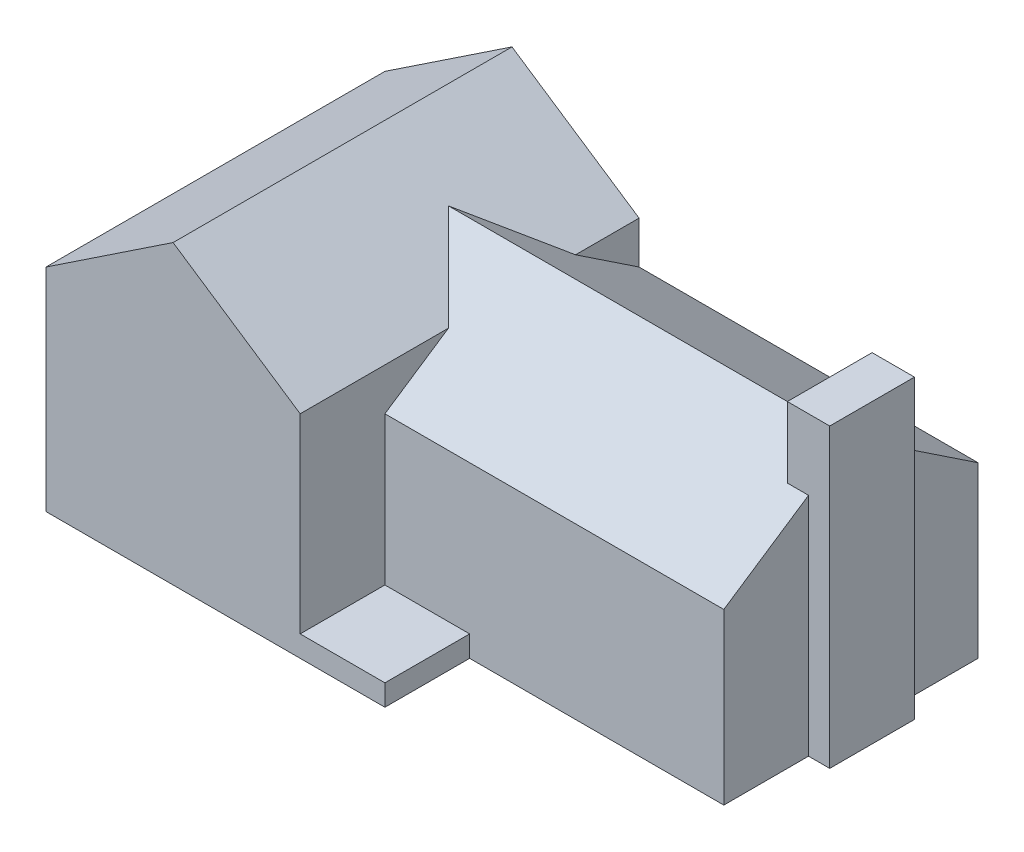
ISO-10303-21;
HEADER;
FILE_DESCRIPTION(('STEP AP214'),'2;1');
FILE_NAME('part.step','',(''),(''),'','','');
FILE_SCHEMA(('AUTOMOTIVE_DESIGN { 1 0 10303 214 1 1 1 1 }'));
ENDSEC;
DATA;
#1=APPLICATION_CONTEXT('core data for automotive mechanical design processes');
#2=APPLICATION_PROTOCOL_DEFINITION('international standard','automotive_design',2000,#1);
#3=PRODUCT_CONTEXT('',#1,'mechanical');
#4=PRODUCT('Part','Part','',(#3));
#5=PRODUCT_RELATED_PRODUCT_CATEGORY('part','',(#4));
#6=PRODUCT_DEFINITION_FORMATION('','',#4);
#7=PRODUCT_DEFINITION_CONTEXT('part definition',#1,'design');
#8=PRODUCT_DEFINITION('design','',#6,#7);
#9=PRODUCT_DEFINITION_SHAPE('','',#8);
#10=(LENGTH_UNIT() NAMED_UNIT(*) SI_UNIT(.MILLI.,.METRE.));
#11=(NAMED_UNIT(*) PLANE_ANGLE_UNIT() SI_UNIT($,.RADIAN.));
#12=(NAMED_UNIT(*) SI_UNIT($,.STERADIAN.) SOLID_ANGLE_UNIT());
#13=UNCERTAINTY_MEASURE_WITH_UNIT(LENGTH_MEASURE(1.E-05),#10,'distance_accuracy_value','');
#14=(GEOMETRIC_REPRESENTATION_CONTEXT(3) GLOBAL_UNCERTAINTY_ASSIGNED_CONTEXT((#13)) GLOBAL_UNIT_ASSIGNED_CONTEXT((#10,
#11,#12)) REPRESENTATION_CONTEXT('',''));
#15=CARTESIAN_POINT('',(0.,0.,0.));
#16=DIRECTION('',(0.,0.,1.));
#17=DIRECTION('',(1.,0.,0.));
#18=AXIS2_PLACEMENT_3D('',#15,#16,#17);
#19=CARTESIAN_POINT('',(70.,0.,0.));
#20=DIRECTION('',(-1.,0.,0.));
#21=DIRECTION('',(0.,0.,1.));
#22=AXIS2_PLACEMENT_3D('',#19,#20,#21);
#23=PLANE('',#22);
#24=DIRECTION('',(0.,0.,-1.));
#25=VECTOR('',#24,1.);
#26=CARTESIAN_POINT('',(70.,0.,-10.));
#27=LINE('',#26,#25);
#28=CARTESIAN_POINT('',(70.,0.,-10.));
#29=VERTEX_POINT('',#28);
#30=CARTESIAN_POINT('',(70.,0.,-20.));
#31=VERTEX_POINT('',#30);
#32=EDGE_CURVE('E63',#29,#31,#27,.T.);
#33=ORIENTED_EDGE('',*,*,#32,.T.);
#34=DIRECTION('',(0.,1.,0.));
#35=VECTOR('',#34,1.);
#36=CARTESIAN_POINT('',(70.,0.,-20.));
#37=LINE('',#36,#35);
#38=CARTESIAN_POINT('',(70.,26.6666666666667,-20.));
#39=VERTEX_POINT('',#38);
#40=EDGE_CURVE('E171',#31,#39,#37,.T.);
#41=ORIENTED_EDGE('',*,*,#40,.T.);
#42=DIRECTION('',(0.,-0.554700196225229,0.832050294337844));
#43=VECTOR('',#42,1.);
#44=CARTESIAN_POINT('',(70.,20.,-10.));
#45=LINE('',#44,#43);
#46=CARTESIAN_POINT('',(70.,20.,-10.));
#47=VERTEX_POINT('',#46);
#48=EDGE_CURVE('E227',#39,#47,#45,.T.);
#49=ORIENTED_EDGE('',*,*,#48,.T.);
#50=DIRECTION('',(0.,-1.,0.));
#51=VECTOR('',#50,1.);
#52=CARTESIAN_POINT('',(70.,0.,-10.));
#53=LINE('',#52,#51);
#54=EDGE_CURVE('E248',#47,#29,#53,.T.);
#55=ORIENTED_EDGE('',*,*,#54,.T.);
#56=EDGE_LOOP('',(#33,#41,#49,#55));
#57=FACE_BOUND('',#56,.T.);
#58=ADVANCED_FACE('F39',(#57),#23,.F.);
#59=CARTESIAN_POINT('',(30.,25.,0.));
#60=DIRECTION('',(-1.,0.,0.));
#61=DIRECTION('',(0.,0.,1.));
#62=AXIS2_PLACEMENT_3D('',#59,#60,#61);
#63=PLANE('',#62);
#64=DIRECTION('',(0.,-1.,0.));
#65=VECTOR('',#64,1.);
#66=CARTESIAN_POINT('',(30.,0.,-10.));
#67=LINE('',#66,#65);
#68=CARTESIAN_POINT('',(30.,20.,-10.));
#69=VERTEX_POINT('',#68);
#70=CARTESIAN_POINT('',(30.,2.5,-10.));
#71=VERTEX_POINT('',#70);
#72=EDGE_CURVE('E247',#69,#71,#67,.T.);
#73=ORIENTED_EDGE('',*,*,#72,.F.);
#74=DIRECTION('',(0.,0.554700196225229,-0.832050294337844));
#75=VECTOR('',#74,1.);
#76=CARTESIAN_POINT('',(30.,16.9230769230769,-5.38461538461538));
#77=LINE('',#76,#75);
#78=CARTESIAN_POINT('',(30.,25.,-17.5));
#79=VERTEX_POINT('',#78);
#80=EDGE_CURVE('E243',#69,#79,#77,.T.);
#81=ORIENTED_EDGE('',*,*,#80,.T.);
#82=DIRECTION('',(0.,0.,-1.));
#83=VECTOR('',#82,1.);
#84=CARTESIAN_POINT('',(30.,25.,0.));
#85=LINE('',#84,#83);
#86=CARTESIAN_POINT('',(30.,25.,0.));
#87=VERTEX_POINT('',#86);
#88=EDGE_CURVE('E319',#87,#79,#85,.T.);
#89=ORIENTED_EDGE('',*,*,#88,.F.);
#90=DIRECTION('',(0.,-1.,0.));
#91=VECTOR('',#90,1.);
#92=CARTESIAN_POINT('',(30.,25.,0.));
#93=LINE('',#92,#91);
#94=CARTESIAN_POINT('',(30.,2.5,0.));
#95=VERTEX_POINT('',#94);
#96=EDGE_CURVE('E340',#87,#95,#93,.T.);
#97=ORIENTED_EDGE('',*,*,#96,.T.);
#98=DIRECTION('',(0.,0.,-1.));
#99=VECTOR('',#98,1.);
#100=CARTESIAN_POINT('',(30.,2.5,0.));
#101=LINE('',#100,#99);
#102=EDGE_CURVE('E276',#95,#71,#101,.T.);
#103=ORIENTED_EDGE('',*,*,#102,.T.);
#104=EDGE_LOOP('',(#73,#81,#89,#97,#103));
#105=FACE_BOUND('',#104,.T.);
#106=ADVANCED_FACE('F390',(#105),#63,.F.);
#107=CARTESIAN_POINT('',(30.,25.,-32.5));
#108=VERTEX_POINT('',#107);
#109=CARTESIAN_POINT('',(30.,25.,-40.));
#110=VERTEX_POINT('',#109);
#111=EDGE_CURVE('E317',#108,#110,#85,.T.);
#112=ORIENTED_EDGE('',*,*,#111,.F.);
#113=DIRECTION('',(0.,-0.554700196225229,-0.832050294337844));
#114=VECTOR('',#113,1.);
#115=CARTESIAN_POINT('',(30.,40.,-10.));
#116=LINE('',#115,#114);
#117=CARTESIAN_POINT('',(30.,20.,-40.));
#118=VERTEX_POINT('',#117);
#119=EDGE_CURVE('E236',#108,#118,#116,.T.);
#120=ORIENTED_EDGE('',*,*,#119,.T.);
#121=DIRECTION('',(0.,-1.,0.));
#122=VECTOR('',#121,1.);
#123=CARTESIAN_POINT('',(30.,25.,-40.));
#124=LINE('',#123,#122);
#125=EDGE_CURVE('E336',#110,#118,#124,.T.);
#126=ORIENTED_EDGE('',*,*,#125,.F.);
#127=EDGE_LOOP('',(#112,#120,#126));
#128=FACE_BOUND('',#127,.T.);
#129=ADVANCED_FACE('F415',(#128),#63,.F.);
#130=CARTESIAN_POINT('',(40.,2.5,0.));
#131=DIRECTION('',(1.,0.,0.));
#132=DIRECTION('',(0.,0.,-1.));
#133=AXIS2_PLACEMENT_3D('',#130,#131,#132);
#134=PLANE('',#133);
#135=DIRECTION('',(0.,0.,1.));
#136=VECTOR('',#135,1.);
#137=CARTESIAN_POINT('',(40.,0.,0.));
#138=LINE('',#137,#136);
#139=CARTESIAN_POINT('',(40.,0.,-10.));
#140=VERTEX_POINT('',#139);
#141=CARTESIAN_POINT('',(40.,0.,0.));
#142=VERTEX_POINT('',#141);
#143=EDGE_CURVE('E275',#140,#142,#138,.T.);
#144=ORIENTED_EDGE('',*,*,#143,.F.);
#145=DIRECTION('',(0.,1.,0.));
#146=VECTOR('',#145,1.);
#147=CARTESIAN_POINT('',(40.,2.5,-10.));
#148=LINE('',#147,#146);
#149=CARTESIAN_POINT('',(40.,2.5,-10.));
#150=VERTEX_POINT('',#149);
#151=EDGE_CURVE('E271',#140,#150,#148,.T.);
#152=ORIENTED_EDGE('',*,*,#151,.T.);
#153=DIRECTION('',(0.,0.,1.));
#154=VECTOR('',#153,1.);
#155=CARTESIAN_POINT('',(40.,2.5,0.));
#156=LINE('',#155,#154);
#157=CARTESIAN_POINT('',(40.,2.5,0.));
#158=VERTEX_POINT('',#157);
#159=EDGE_CURVE('E280',#150,#158,#156,.T.);
#160=ORIENTED_EDGE('',*,*,#159,.T.);
#161=DIRECTION('',(0.,-1.,0.));
#162=VECTOR('',#161,1.);
#163=CARTESIAN_POINT('',(40.,2.5,0.));
#164=LINE('',#163,#162);
#165=EDGE_CURVE('E287',#158,#142,#164,.T.);
#166=ORIENTED_EDGE('',*,*,#165,.T.);
#167=EDGE_LOOP('',(#144,#152,#160,#166));
#168=FACE_BOUND('',#167,.T.);
#169=ADVANCED_FACE('F379',(#168),#134,.T.);
#170=CARTESIAN_POINT('',(0.,2.5,0.));
#171=DIRECTION('',(0.,-1.,0.));
#172=DIRECTION('',(0.,0.,-1.));
#173=AXIS2_PLACEMENT_3D('',#170,#171,#172);
#174=PLANE('',#173);
#175=DIRECTION('',(1.,0.,0.));
#176=VECTOR('',#175,1.);
#177=CARTESIAN_POINT('',(0.,2.5,-10.));
#178=LINE('',#177,#176);
#179=EDGE_CURVE('E348',#71,#150,#178,.T.);
#180=ORIENTED_EDGE('',*,*,#179,.F.);
#181=ORIENTED_EDGE('',*,*,#102,.F.);
#182=DIRECTION('',(-1.,0.,0.));
#183=VECTOR('',#182,1.);
#184=CARTESIAN_POINT('',(30.,2.5,0.));
#185=LINE('',#184,#183);
#186=EDGE_CURVE('E283',#158,#95,#185,.T.);
#187=ORIENTED_EDGE('',*,*,#186,.F.);
#188=ORIENTED_EDGE('',*,*,#159,.F.);
#189=EDGE_LOOP('',(#180,#181,#187,#188));
#190=FACE_BOUND('',#189,.T.);
#191=ADVANCED_FACE('F387',(#190),#174,.F.);
#192=CARTESIAN_POINT('',(0.,25.,0.));
#193=DIRECTION('',(1.,0.,0.));
#194=DIRECTION('',(0.,0.,-1.));
#195=AXIS2_PLACEMENT_3D('',#192,#193,#194);
#196=PLANE('',#195);
#197=DIRECTION('',(0.,0.,1.));
#198=VECTOR('',#197,1.);
#199=CARTESIAN_POINT('',(0.,0.,0.));
#200=LINE('',#199,#198);
#201=CARTESIAN_POINT('',(0.,0.,-40.));
#202=VERTEX_POINT('',#201);
#203=CARTESIAN_POINT('',(0.,0.,0.));
#204=VERTEX_POINT('',#203);
#205=EDGE_CURVE('E312',#202,#204,#200,.T.);
#206=ORIENTED_EDGE('',*,*,#205,.T.);
#207=DIRECTION('',(0.,-1.,0.));
#208=VECTOR('',#207,1.);
#209=CARTESIAN_POINT('',(0.,25.,0.));
#210=LINE('',#209,#208);
#211=CARTESIAN_POINT('',(0.,25.,0.));
#212=VERTEX_POINT('',#211);
#213=EDGE_CURVE('E344',#212,#204,#210,.T.);
#214=ORIENTED_EDGE('',*,*,#213,.F.);
#215=DIRECTION('',(0.,0.,1.));
#216=VECTOR('',#215,1.);
#217=CARTESIAN_POINT('',(0.,25.,0.));
#218=LINE('',#217,#216);
#219=CARTESIAN_POINT('',(0.,25.,-40.));
#220=VERTEX_POINT('',#219);
#221=EDGE_CURVE('E313',#220,#212,#218,.T.);
#222=ORIENTED_EDGE('',*,*,#221,.F.);
#223=DIRECTION('',(0.,-1.,0.));
#224=VECTOR('',#223,1.);
#225=CARTESIAN_POINT('',(0.,25.,-40.));
#226=LINE('',#225,#224);
#227=EDGE_CURVE('E323',#220,#202,#226,.T.);
#228=ORIENTED_EDGE('',*,*,#227,.T.);
#229=EDGE_LOOP('',(#206,#214,#222,#228));
#230=FACE_BOUND('',#229,.T.);
#231=ADVANCED_FACE('F41',(#230),#196,.F.);
#232=CARTESIAN_POINT('',(0.,25.,0.));
#233=DIRECTION('',(0.,0.,-1.));
#234=DIRECTION('',(-1.,0.,0.));
#235=AXIS2_PLACEMENT_3D('',#232,#233,#234);
#236=PLANE('',#235);
#237=DIRECTION('',(1.,0.,0.));
#238=VECTOR('',#237,1.);
#239=CARTESIAN_POINT('',(0.,0.,0.));
#240=LINE('',#239,#238);
#241=EDGE_CURVE('E327',#204,#142,#240,.T.);
#242=ORIENTED_EDGE('',*,*,#241,.T.);
#243=ORIENTED_EDGE('',*,*,#165,.F.);
#244=ORIENTED_EDGE('',*,*,#186,.T.);
#245=ORIENTED_EDGE('',*,*,#96,.F.);
#246=DIRECTION('',(-0.832050294337843,0.554700196225229,0.));
#247=VECTOR('',#246,1.);
#248=CARTESIAN_POINT('',(30.,25.,0.));
#249=LINE('',#248,#247);
#250=CARTESIAN_POINT('',(15.,35.,0.));
#251=VERTEX_POINT('',#250);
#252=EDGE_CURVE('E293',#87,#251,#249,.T.);
#253=ORIENTED_EDGE('',*,*,#252,.T.);
#254=DIRECTION('',(-0.832050294337843,-0.554700196225229,0.));
#255=VECTOR('',#254,1.);
#256=CARTESIAN_POINT('',(15.,35.,0.));
#257=LINE('',#256,#255);
#258=EDGE_CURVE('E299',#251,#212,#257,.T.);
#259=ORIENTED_EDGE('',*,*,#258,.T.);
#260=ORIENTED_EDGE('',*,*,#213,.T.);
#261=EDGE_LOOP('',(#242,#243,#244,#245,#253,#259,#260));
#262=FACE_BOUND('',#261,.T.);
#263=ADVANCED_FACE('F384',(#262),#236,.F.);
#264=CARTESIAN_POINT('',(0.,25.,-40.));
#265=DIRECTION('',(0.,0.,1.));
#266=DIRECTION('',(1.,0.,0.));
#267=AXIS2_PLACEMENT_3D('',#264,#265,#266);
#268=PLANE('',#267);
#269=ORIENTED_EDGE('',*,*,#125,.T.);
#270=DIRECTION('',(-1.,0.,0.));
#271=VECTOR('',#270,1.);
#272=CARTESIAN_POINT('',(70.,20.,-40.));
#273=LINE('',#272,#271);
#274=CARTESIAN_POINT('',(70.,20.,-40.));
#275=VERTEX_POINT('',#274);
#276=EDGE_CURVE('E264',#275,#118,#273,.T.);
#277=ORIENTED_EDGE('',*,*,#276,.F.);
#278=DIRECTION('',(0.,1.,0.));
#279=VECTOR('',#278,1.);
#280=CARTESIAN_POINT('',(70.,0.,-40.));
#281=LINE('',#280,#279);
#282=CARTESIAN_POINT('',(70.,0.,-40.));
#283=VERTEX_POINT('',#282);
#284=EDGE_CURVE('E254',#283,#275,#281,.T.);
#285=ORIENTED_EDGE('',*,*,#284,.F.);
#286=DIRECTION('',(-1.,0.,0.));
#287=VECTOR('',#286,1.);
#288=CARTESIAN_POINT('',(0.,0.,-40.));
#289=LINE('',#288,#287);
#290=EDGE_CURVE('E318',#283,#202,#289,.T.);
#291=ORIENTED_EDGE('',*,*,#290,.T.);
#292=ORIENTED_EDGE('',*,*,#227,.F.);
#293=DIRECTION('',(-0.832050294337843,-0.554700196225229,0.));
#294=VECTOR('',#293,1.);
#295=CARTESIAN_POINT('',(15.,35.,-40.));
#296=LINE('',#295,#294);
#297=CARTESIAN_POINT('',(15.,35.,-40.));
#298=VERTEX_POINT('',#297);
#299=EDGE_CURVE('E298',#298,#220,#296,.T.);
#300=ORIENTED_EDGE('',*,*,#299,.F.);
#301=DIRECTION('',(-0.832050294337843,0.554700196225229,0.));
#302=VECTOR('',#301,1.);
#303=CARTESIAN_POINT('',(30.,25.,-40.));
#304=LINE('',#303,#302);
#305=EDGE_CURVE('E294',#110,#298,#304,.T.);
#306=ORIENTED_EDGE('',*,*,#305,.F.);
#307=EDGE_LOOP('',(#269,#277,#285,#291,#292,#300,#306));
#308=FACE_BOUND('',#307,.T.);
#309=ADVANCED_FACE('F402',(#308),#268,.F.);
#310=CARTESIAN_POINT('',(0.,0.,0.));
#311=DIRECTION('',(0.,-1.,0.));
#312=DIRECTION('',(0.,0.,-1.));
#313=AXIS2_PLACEMENT_3D('',#310,#311,#312);
#314=PLANE('',#313);
#315=CARTESIAN_POINT('',(70.,0.,-30.));
#316=VERTEX_POINT('',#315);
#317=EDGE_CURVE('E251',#316,#283,#27,.T.);
#318=ORIENTED_EDGE('',*,*,#317,.F.);
#319=DIRECTION('',(1.,0.,0.));
#320=VECTOR('',#319,1.);
#321=CARTESIAN_POINT('',(67.5,0.,-30.));
#322=LINE('',#321,#320);
#323=CARTESIAN_POINT('',(72.5,0.,-30.));
#324=VERTEX_POINT('',#323);
#325=EDGE_CURVE('E174',#316,#324,#322,.T.);
#326=ORIENTED_EDGE('',*,*,#325,.T.);
#327=DIRECTION('',(0.,0.,-1.));
#328=VECTOR('',#327,1.);
#329=CARTESIAN_POINT('',(72.5,0.,-20.));
#330=LINE('',#329,#328);
#331=CARTESIAN_POINT('',(72.5,0.,-20.));
#332=VERTEX_POINT('',#331);
#333=EDGE_CURVE('E178',#332,#324,#330,.T.);
#334=ORIENTED_EDGE('',*,*,#333,.F.);
#335=DIRECTION('',(1.,0.,0.));
#336=VECTOR('',#335,1.);
#337=CARTESIAN_POINT('',(67.5,0.,-20.));
#338=LINE('',#337,#336);
#339=EDGE_CURVE('E166',#31,#332,#338,.T.);
#340=ORIENTED_EDGE('',*,*,#339,.F.);
#341=ORIENTED_EDGE('',*,*,#32,.F.);
#342=DIRECTION('',(-1.,0.,0.));
#343=VECTOR('',#342,1.);
#344=CARTESIAN_POINT('',(70.,0.,-10.));
#345=LINE('',#344,#343);
#346=EDGE_CURVE('E267',#29,#140,#345,.T.);
#347=ORIENTED_EDGE('',*,*,#346,.T.);
#348=ORIENTED_EDGE('',*,*,#143,.T.);
#349=ORIENTED_EDGE('',*,*,#241,.F.);
#350=ORIENTED_EDGE('',*,*,#205,.F.);
#351=ORIENTED_EDGE('',*,*,#290,.F.);
#352=EDGE_LOOP('',(#318,#326,#334,#340,#341,#347,#348,#349,#350,#351));
#353=FACE_BOUND('',#352,.T.);
#354=ADVANCED_FACE('F179',(#353),#314,.T.);
#355=CARTESIAN_POINT('',(15.,35.,-40.));
#356=DIRECTION('',(-0.554700196225229,0.832050294337844,0.));
#357=DIRECTION('',(-0.832050294337844,-0.554700196225229,0.));
#358=AXIS2_PLACEMENT_3D('',#355,#356,#357);
#359=PLANE('',#358);
#360=ORIENTED_EDGE('',*,*,#258,.F.);
#361=DIRECTION('',(0.,0.,1.));
#362=VECTOR('',#361,1.);
#363=CARTESIAN_POINT('',(15.,35.,-40.));
#364=LINE('',#363,#362);
#365=EDGE_CURVE('E303',#298,#251,#364,.T.);
#366=ORIENTED_EDGE('',*,*,#365,.F.);
#367=ORIENTED_EDGE('',*,*,#299,.T.);
#368=ORIENTED_EDGE('',*,*,#221,.T.);
#369=EDGE_LOOP('',(#360,#366,#367,#368));
#370=FACE_BOUND('',#369,.T.);
#371=ADVANCED_FACE('F396',(#370),#359,.T.);
#372=CARTESIAN_POINT('',(30.,25.,-40.));
#373=DIRECTION('',(0.554700196225229,0.832050294337844,0.));
#374=DIRECTION('',(-0.832050294337844,0.554700196225229,0.));
#375=AXIS2_PLACEMENT_3D('',#372,#373,#374);
#376=PLANE('',#375);
#377=DIRECTION('',(0.639602149066831,-0.426401432711221,0.639602149066831));
#378=VECTOR('',#377,1.);
#379=CARTESIAN_POINT('',(20.7954545454545,31.1363636363636,-26.7045454545455));
#380=LINE('',#379,#378);
#381=CARTESIAN_POINT('',(22.5,30.,-25.));
#382=VERTEX_POINT('',#381);
#383=EDGE_CURVE('E240',#382,#79,#380,.T.);
#384=ORIENTED_EDGE('',*,*,#383,.F.);
#385=DIRECTION('',(-0.639602149066831,0.426401432711221,0.639602149066831));
#386=VECTOR('',#385,1.);
#387=CARTESIAN_POINT('',(33.0681818181818,22.9545454545454,-35.5681818181818));
#388=LINE('',#387,#386);
#389=EDGE_CURVE('E233',#108,#382,#388,.T.);
#390=ORIENTED_EDGE('',*,*,#389,.F.);
#391=ORIENTED_EDGE('',*,*,#111,.T.);
#392=ORIENTED_EDGE('',*,*,#305,.T.);
#393=ORIENTED_EDGE('',*,*,#365,.T.);
#394=ORIENTED_EDGE('',*,*,#252,.F.);
#395=ORIENTED_EDGE('',*,*,#88,.T.);
#396=EDGE_LOOP('',(#384,#390,#391,#392,#393,#394,#395));
#397=FACE_BOUND('',#396,.T.);
#398=ADVANCED_FACE('F413',(#397),#376,.T.);
#399=CARTESIAN_POINT('',(70.,0.,-10.));
#400=DIRECTION('',(0.,0.,-1.));
#401=DIRECTION('',(-1.,0.,0.));
#402=AXIS2_PLACEMENT_3D('',#399,#400,#401);
#403=PLANE('',#402);
#404=ORIENTED_EDGE('',*,*,#151,.F.);
#405=ORIENTED_EDGE('',*,*,#346,.F.);
#406=ORIENTED_EDGE('',*,*,#54,.F.);
#407=DIRECTION('',(-1.,0.,0.));
#408=VECTOR('',#407,1.);
#409=CARTESIAN_POINT('',(70.,20.,-10.));
#410=LINE('',#409,#408);
#411=EDGE_CURVE('E258',#47,#69,#410,.T.);
#412=ORIENTED_EDGE('',*,*,#411,.T.);
#413=ORIENTED_EDGE('',*,*,#72,.T.);
#414=ORIENTED_EDGE('',*,*,#179,.T.);
#415=EDGE_LOOP('',(#404,#405,#406,#412,#413,#414));
#416=FACE_BOUND('',#415,.T.);
#417=ADVANCED_FACE('F376',(#416),#403,.F.);
#418=DIRECTION('',(0.,0.554700196225229,0.832050294337844));
#419=VECTOR('',#418,1.);
#420=CARTESIAN_POINT('',(70.,30.,-25.));
#421=LINE('',#420,#419);
#422=CARTESIAN_POINT('',(70.,26.6666666666667,-30.));
#423=VERTEX_POINT('',#422);
#424=EDGE_CURVE('E224',#275,#423,#421,.T.);
#425=ORIENTED_EDGE('',*,*,#424,.T.);
#426=DIRECTION('',(0.,-1.,0.));
#427=VECTOR('',#426,1.);
#428=CARTESIAN_POINT('',(70.,0.,-30.));
#429=LINE('',#428,#427);
#430=EDGE_CURVE('E55',#423,#316,#429,.T.);
#431=ORIENTED_EDGE('',*,*,#430,.T.);
#432=ORIENTED_EDGE('',*,*,#317,.T.);
#433=ORIENTED_EDGE('',*,*,#284,.T.);
#434=EDGE_LOOP('',(#425,#431,#432,#433));
#435=FACE_BOUND('',#434,.T.);
#436=ADVANCED_FACE('F417',(#435),#23,.F.);
#437=CARTESIAN_POINT('',(15.,20.,-10.));
#438=DIRECTION('',(0.,0.832050294337844,0.554700196225229));
#439=DIRECTION('',(0.,-0.554700196225229,0.832050294337844));
#440=AXIS2_PLACEMENT_3D('',#437,#438,#439);
#441=PLANE('',#440);
#442=DIRECTION('',(1.,0.,0.));
#443=VECTOR('',#442,1.);
#444=CARTESIAN_POINT('',(15.,26.6666666666667,-20.));
#445=LINE('',#444,#443);
#446=CARTESIAN_POINT('',(67.5,26.6666666666667,-20.));
#447=VERTEX_POINT('',#446);
#448=EDGE_CURVE('E11',#447,#39,#445,.T.);
#449=ORIENTED_EDGE('',*,*,#448,.F.);
#450=DIRECTION('',(0.,-0.554700196225229,0.832050294337844));
#451=VECTOR('',#450,1.);
#452=CARTESIAN_POINT('',(67.5,20.,-10.));
#453=LINE('',#452,#451);
#454=CARTESIAN_POINT('',(67.5,30.,-25.));
#455=VERTEX_POINT('',#454);
#456=EDGE_CURVE('E211',#455,#447,#453,.T.);
#457=ORIENTED_EDGE('',*,*,#456,.F.);
#458=DIRECTION('',(1.,0.,0.));
#459=VECTOR('',#458,1.);
#460=CARTESIAN_POINT('',(15.,30.,-25.));
#461=LINE('',#460,#459);
#462=EDGE_CURVE('E230',#382,#455,#461,.T.);
#463=ORIENTED_EDGE('',*,*,#462,.F.);
#464=ORIENTED_EDGE('',*,*,#383,.T.);
#465=ORIENTED_EDGE('',*,*,#80,.F.);
#466=ORIENTED_EDGE('',*,*,#411,.F.);
#467=ORIENTED_EDGE('',*,*,#48,.F.);
#468=EDGE_LOOP('',(#449,#457,#463,#464,#465,#466,#467));
#469=FACE_BOUND('',#468,.T.);
#470=ADVANCED_FACE('F370',(#469),#441,.T.);
#471=CARTESIAN_POINT('',(15.,30.,-25.));
#472=DIRECTION('',(0.,0.832050294337844,-0.554700196225229));
#473=DIRECTION('',(0.,0.554700196225229,0.832050294337844));
#474=AXIS2_PLACEMENT_3D('',#471,#472,#473);
#475=PLANE('',#474);
#476=DIRECTION('',(-1.,0.,0.));
#477=VECTOR('',#476,1.);
#478=CARTESIAN_POINT('',(15.,26.6666666666667,-30.));
#479=LINE('',#478,#477);
#480=CARTESIAN_POINT('',(67.5,26.6666666666667,-30.));
#481=VERTEX_POINT('',#480);
#482=EDGE_CURVE('E48',#423,#481,#479,.T.);
#483=ORIENTED_EDGE('',*,*,#482,.F.);
#484=ORIENTED_EDGE('',*,*,#424,.F.);
#485=ORIENTED_EDGE('',*,*,#276,.T.);
#486=ORIENTED_EDGE('',*,*,#119,.F.);
#487=ORIENTED_EDGE('',*,*,#389,.T.);
#488=ORIENTED_EDGE('',*,*,#462,.T.);
#489=DIRECTION('',(0.,0.554700196225229,0.832050294337844));
#490=VECTOR('',#489,1.);
#491=CARTESIAN_POINT('',(67.5,30.,-25.));
#492=LINE('',#491,#490);
#493=EDGE_CURVE('E351',#481,#455,#492,.T.);
#494=ORIENTED_EDGE('',*,*,#493,.F.);
#495=EDGE_LOOP('',(#483,#484,#485,#486,#487,#488,#494));
#496=FACE_BOUND('',#495,.T.);
#497=ADVANCED_FACE('F416',(#496),#475,.T.);
#498=CARTESIAN_POINT('',(67.5,0.,-20.));
#499=DIRECTION('',(0.,0.,1.));
#500=DIRECTION('',(1.,0.,0.));
#501=AXIS2_PLACEMENT_3D('',#498,#499,#500);
#502=PLANE('',#501);
#503=ORIENTED_EDGE('',*,*,#40,.F.);
#504=ORIENTED_EDGE('',*,*,#339,.T.);
#505=DIRECTION('',(0.,-1.,0.));
#506=VECTOR('',#505,1.);
#507=CARTESIAN_POINT('',(72.5,0.,-20.));
#508=LINE('',#507,#506);
#509=CARTESIAN_POINT('',(72.5,35.,-20.));
#510=VERTEX_POINT('',#509);
#511=EDGE_CURVE('E170',#510,#332,#508,.T.);
#512=ORIENTED_EDGE('',*,*,#511,.F.);
#513=DIRECTION('',(1.,0.,0.));
#514=VECTOR('',#513,1.);
#515=CARTESIAN_POINT('',(67.5,35.,-20.));
#516=LINE('',#515,#514);
#517=CARTESIAN_POINT('',(67.5,35.,-20.));
#518=VERTEX_POINT('',#517);
#519=EDGE_CURVE('E208',#518,#510,#516,.T.);
#520=ORIENTED_EDGE('',*,*,#519,.F.);
#521=DIRECTION('',(0.,-1.,0.));
#522=VECTOR('',#521,1.);
#523=CARTESIAN_POINT('',(67.5,0.,-20.));
#524=LINE('',#523,#522);
#525=EDGE_CURVE('E198',#518,#447,#524,.T.);
#526=ORIENTED_EDGE('',*,*,#525,.T.);
#527=ORIENTED_EDGE('',*,*,#448,.T.);
#528=EDGE_LOOP('',(#503,#504,#512,#520,#526,#527));
#529=FACE_BOUND('',#528,.T.);
#530=ADVANCED_FACE('F168',(#529),#502,.T.);
#531=CARTESIAN_POINT('',(67.5,0.,-30.));
#532=DIRECTION('',(0.,0.,-1.));
#533=DIRECTION('',(-1.,0.,0.));
#534=AXIS2_PLACEMENT_3D('',#531,#532,#533);
#535=PLANE('',#534);
#536=ORIENTED_EDGE('',*,*,#430,.F.);
#537=ORIENTED_EDGE('',*,*,#482,.T.);
#538=DIRECTION('',(0.,1.,0.));
#539=VECTOR('',#538,1.);
#540=CARTESIAN_POINT('',(67.5,0.,-30.));
#541=LINE('',#540,#539);
#542=CARTESIAN_POINT('',(67.5,35.,-30.));
#543=VERTEX_POINT('',#542);
#544=EDGE_CURVE('E202',#481,#543,#541,.T.);
#545=ORIENTED_EDGE('',*,*,#544,.T.);
#546=DIRECTION('',(1.,0.,0.));
#547=VECTOR('',#546,1.);
#548=CARTESIAN_POINT('',(67.5,35.,-30.));
#549=LINE('',#548,#547);
#550=CARTESIAN_POINT('',(72.5,35.,-30.));
#551=VERTEX_POINT('',#550);
#552=EDGE_CURVE('E212',#543,#551,#549,.T.);
#553=ORIENTED_EDGE('',*,*,#552,.T.);
#554=DIRECTION('',(0.,1.,0.));
#555=VECTOR('',#554,1.);
#556=CARTESIAN_POINT('',(72.5,0.,-30.));
#557=LINE('',#556,#555);
#558=EDGE_CURVE('E185',#324,#551,#557,.T.);
#559=ORIENTED_EDGE('',*,*,#558,.F.);
#560=ORIENTED_EDGE('',*,*,#325,.F.);
#561=EDGE_LOOP('',(#536,#537,#545,#553,#559,#560));
#562=FACE_BOUND('',#561,.T.);
#563=ADVANCED_FACE('F358',(#562),#535,.T.);
#564=CARTESIAN_POINT('',(67.5,35.,-20.));
#565=DIRECTION('',(0.,1.,0.));
#566=DIRECTION('',(0.,0.,1.));
#567=AXIS2_PLACEMENT_3D('',#564,#565,#566);
#568=PLANE('',#567);
#569=ORIENTED_EDGE('',*,*,#519,.T.);
#570=DIRECTION('',(0.,0.,1.));
#571=VECTOR('',#570,1.);
#572=CARTESIAN_POINT('',(72.5,35.,-20.));
#573=LINE('',#572,#571);
#574=EDGE_CURVE('E190',#551,#510,#573,.T.);
#575=ORIENTED_EDGE('',*,*,#574,.F.);
#576=ORIENTED_EDGE('',*,*,#552,.F.);
#577=DIRECTION('',(0.,0.,1.));
#578=VECTOR('',#577,1.);
#579=CARTESIAN_POINT('',(67.5,35.,-20.));
#580=LINE('',#579,#578);
#581=EDGE_CURVE('E175',#543,#518,#580,.T.);
#582=ORIENTED_EDGE('',*,*,#581,.T.);
#583=EDGE_LOOP('',(#569,#575,#576,#582));
#584=FACE_BOUND('',#583,.T.);
#585=ADVANCED_FACE('F366',(#584),#568,.T.);
#586=CARTESIAN_POINT('',(67.5,0.,0.));
#587=DIRECTION('',(-1.,0.,0.));
#588=DIRECTION('',(0.,0.,1.));
#589=AXIS2_PLACEMENT_3D('',#586,#587,#588);
#590=PLANE('',#589);
#591=ORIENTED_EDGE('',*,*,#493,.T.);
#592=ORIENTED_EDGE('',*,*,#456,.T.);
#593=ORIENTED_EDGE('',*,*,#525,.F.);
#594=ORIENTED_EDGE('',*,*,#581,.F.);
#595=ORIENTED_EDGE('',*,*,#544,.F.);
#596=EDGE_LOOP('',(#591,#592,#593,#594,#595));
#597=FACE_BOUND('',#596,.T.);
#598=ADVANCED_FACE('F363',(#597),#590,.T.);
#599=CARTESIAN_POINT('',(72.5,0.,0.));
#600=DIRECTION('',(-1.,0.,0.));
#601=DIRECTION('',(0.,0.,1.));
#602=AXIS2_PLACEMENT_3D('',#599,#600,#601);
#603=PLANE('',#602);
#604=ORIENTED_EDGE('',*,*,#511,.T.);
#605=ORIENTED_EDGE('',*,*,#333,.T.);
#606=ORIENTED_EDGE('',*,*,#558,.T.);
#607=ORIENTED_EDGE('',*,*,#574,.T.);
#608=EDGE_LOOP('',(#604,#605,#606,#607));
#609=FACE_BOUND('',#608,.T.);
#610=ADVANCED_FACE('F188',(#609),#603,.F.);
#611=CLOSED_SHELL('',(#58,#106,#129,#169,#191,#231,#263,#309,#354,#371,#398,#417,#436,#470,#497,
#530,#563,#585,#598,#610));
#612=MANIFOLD_SOLID_BREP('B2',#611);
#613=ADVANCED_BREP_SHAPE_REPRESENTATION('',(#18,#612),#14);
#614=SHAPE_DEFINITION_REPRESENTATION(#9,#613);
ENDSEC;
END-ISO-10303-21;
